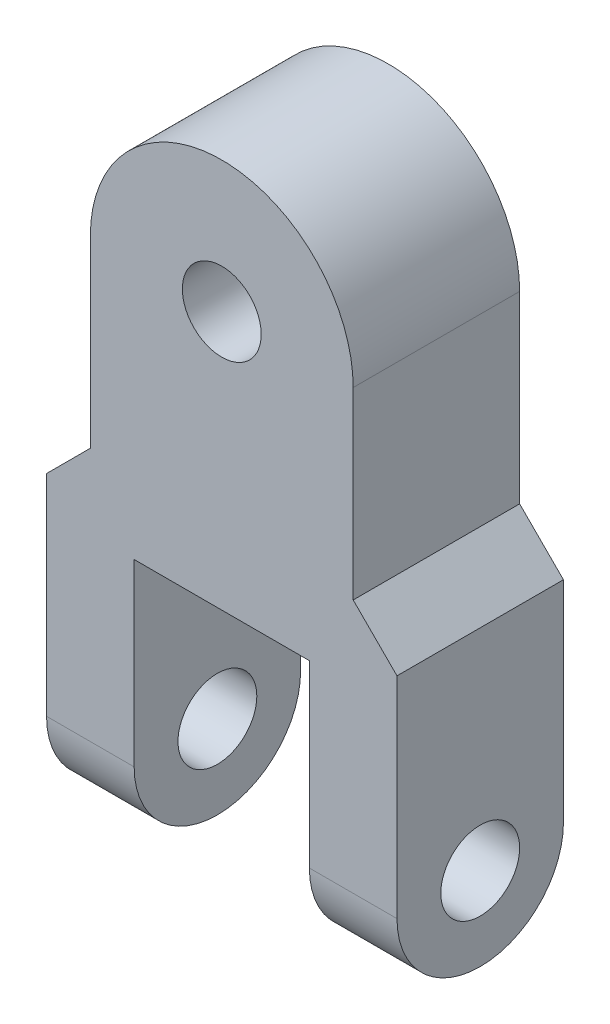
ISO-10303-21;
HEADER;
FILE_DESCRIPTION(('STEP AP214'),'2;1');
FILE_NAME('part.step','',(''),(''),'','','');
FILE_SCHEMA(('AUTOMOTIVE_DESIGN { 1 0 10303 214 1 1 1 1 }'));
ENDSEC;
DATA;
#1=APPLICATION_CONTEXT('core data for automotive mechanical design processes');
#2=APPLICATION_PROTOCOL_DEFINITION('international standard','automotive_design',2000,#1);
#3=PRODUCT_CONTEXT('',#1,'mechanical');
#4=PRODUCT('Part','Part','',(#3));
#5=PRODUCT_RELATED_PRODUCT_CATEGORY('part','',(#4));
#6=PRODUCT_DEFINITION_FORMATION('','',#4);
#7=PRODUCT_DEFINITION_CONTEXT('part definition',#1,'design');
#8=PRODUCT_DEFINITION('design','',#6,#7);
#9=PRODUCT_DEFINITION_SHAPE('','',#8);
#10=(LENGTH_UNIT() NAMED_UNIT(*) SI_UNIT(.MILLI.,.METRE.));
#11=(NAMED_UNIT(*) PLANE_ANGLE_UNIT() SI_UNIT($,.RADIAN.));
#12=(NAMED_UNIT(*) SI_UNIT($,.STERADIAN.) SOLID_ANGLE_UNIT());
#13=UNCERTAINTY_MEASURE_WITH_UNIT(LENGTH_MEASURE(1.E-05),#10,'distance_accuracy_value','');
#14=(GEOMETRIC_REPRESENTATION_CONTEXT(3) GLOBAL_UNCERTAINTY_ASSIGNED_CONTEXT((#13)) GLOBAL_UNIT_ASSIGNED_CONTEXT((#10,
#11,#12)) REPRESENTATION_CONTEXT('',''));
#15=CARTESIAN_POINT('',(0.,0.,0.));
#16=DIRECTION('',(0.,0.,1.));
#17=DIRECTION('',(1.,0.,0.));
#18=AXIS2_PLACEMENT_3D('',#15,#16,#17);
#19=CARTESIAN_POINT('',(7.5,10.,9.5));
#20=DIRECTION('',(0.,0.,-1.));
#21=DIRECTION('',(-1.,0.,0.));
#22=AXIS2_PLACEMENT_3D('',#19,#20,#21);
#23=PLANE('',#22);
#24=CARTESIAN_POINT('',(7.5,10.,9.5));
#25=DIRECTION('',(0.,0.,1.));
#26=DIRECTION('',(1.,0.,0.));
#27=AXIS2_PLACEMENT_3D('',#24,#25,#26);
#28=CIRCLE('',#27,2.25);
#29=CARTESIAN_POINT('',(9.75,10.,9.5));
#30=VERTEX_POINT('',#29);
#31=EDGE_CURVE('E197',#30,#30,#28,.T.);
#32=ORIENTED_EDGE('',*,*,#31,.F.);
#33=EDGE_LOOP('',(#32));
#34=FACE_BOUND('',#33,.T.);
#35=DIRECTION('',(0.,-1.,0.));
#36=VECTOR('',#35,1.);
#37=CARTESIAN_POINT('',(0.,0.,9.5));
#38=LINE('',#37,#36);
#39=CARTESIAN_POINT('',(0.,10.,9.5));
#40=VERTEX_POINT('',#39);
#41=CARTESIAN_POINT('',(0.,-0.500000000000047,9.5));
#42=VERTEX_POINT('',#41);
#43=EDGE_CURVE('E202',#40,#42,#38,.T.);
#44=ORIENTED_EDGE('',*,*,#43,.T.);
#45=DIRECTION('',(-0.707106781186551,-0.707106781186544,0.));
#46=VECTOR('',#45,1.);
#47=CARTESIAN_POINT('',(0.500000000000052,0.,9.5));
#48=LINE('',#47,#46);
#49=CARTESIAN_POINT('',(-2.5,-3.00000000000002,9.5));
#50=VERTEX_POINT('',#49);
#51=EDGE_CURVE('E225',#42,#50,#48,.T.);
#52=ORIENTED_EDGE('',*,*,#51,.T.);
#53=DIRECTION('',(0.,-1.,0.));
#54=VECTOR('',#53,1.);
#55=CARTESIAN_POINT('',(-2.5,0.,9.5));
#56=LINE('',#55,#54);
#57=CARTESIAN_POINT('',(-2.5,-15.,9.5));
#58=VERTEX_POINT('',#57);
#59=EDGE_CURVE('E181',#50,#58,#56,.T.);
#60=ORIENTED_EDGE('',*,*,#59,.T.);
#61=DIRECTION('',(1.,0.,0.));
#62=VECTOR('',#61,1.);
#63=CARTESIAN_POINT('',(-2.5,-15.,9.5));
#64=LINE('',#63,#62);
#65=CARTESIAN_POINT('',(2.5,-15.,9.5));
#66=VERTEX_POINT('',#65);
#67=EDGE_CURVE('E194',#58,#66,#64,.T.);
#68=ORIENTED_EDGE('',*,*,#67,.T.);
#69=DIRECTION('',(0.,1.,0.));
#70=VECTOR('',#69,1.);
#71=CARTESIAN_POINT('',(2.5,-19.75,9.5));
#72=LINE('',#71,#70);
#73=CARTESIAN_POINT('',(2.50000000000001,-4.75,9.5));
#74=VERTEX_POINT('',#73);
#75=EDGE_CURVE('E160',#66,#74,#72,.T.);
#76=ORIENTED_EDGE('',*,*,#75,.T.);
#77=DIRECTION('',(1.,0.,0.));
#78=VECTOR('',#77,1.);
#79=CARTESIAN_POINT('',(12.5,-4.75,9.5));
#80=LINE('',#79,#78);
#81=CARTESIAN_POINT('',(12.5,-4.75,9.5));
#82=VERTEX_POINT('',#81);
#83=EDGE_CURVE('E144',#74,#82,#80,.T.);
#84=ORIENTED_EDGE('',*,*,#83,.T.);
#85=DIRECTION('',(0.,-1.,0.));
#86=VECTOR('',#85,1.);
#87=CARTESIAN_POINT('',(12.5,-19.75,9.5));
#88=LINE('',#87,#86);
#89=CARTESIAN_POINT('',(12.5,-15.,9.5));
#90=VERTEX_POINT('',#89);
#91=EDGE_CURVE('E157',#82,#90,#88,.T.);
#92=ORIENTED_EDGE('',*,*,#91,.T.);
#93=CARTESIAN_POINT('',(17.5,-15.,9.5));
#94=VERTEX_POINT('',#93);
#95=EDGE_CURVE('E189',#90,#94,#64,.T.);
#96=ORIENTED_EDGE('',*,*,#95,.T.);
#97=DIRECTION('',(0.,-1.,0.));
#98=VECTOR('',#97,1.);
#99=CARTESIAN_POINT('',(17.5,0.,9.5));
#100=LINE('',#99,#98);
#101=CARTESIAN_POINT('',(17.5,-3.00000000000005,9.5));
#102=VERTEX_POINT('',#101);
#103=EDGE_CURVE('E170',#102,#94,#100,.T.);
#104=ORIENTED_EDGE('',*,*,#103,.F.);
#105=DIRECTION('',(0.707106781186544,-0.707106781186551,0.));
#106=VECTOR('',#105,1.);
#107=CARTESIAN_POINT('',(17.5,-3.00000000000005,9.5));
#108=LINE('',#107,#106);
#109=CARTESIAN_POINT('',(15.,-0.500000000000025,9.5));
#110=VERTEX_POINT('',#109);
#111=EDGE_CURVE('E218',#102,#110,#108,.F.);
#112=ORIENTED_EDGE('',*,*,#111,.T.);
#113=DIRECTION('',(0.,1.,0.));
#114=VECTOR('',#113,1.);
#115=CARTESIAN_POINT('',(15.,0.,9.5));
#116=LINE('',#115,#114);
#117=CARTESIAN_POINT('',(15.,10.,9.5));
#118=VERTEX_POINT('',#117);
#119=EDGE_CURVE('E204',#110,#118,#116,.T.);
#120=ORIENTED_EDGE('',*,*,#119,.T.);
#121=CARTESIAN_POINT('',(7.5,10.,9.5));
#122=DIRECTION('',(0.,0.,1.));
#123=DIRECTION('',(-1.,0.,0.));
#124=AXIS2_PLACEMENT_3D('',#121,#122,#123);
#125=CIRCLE('',#124,7.5);
#126=EDGE_CURVE('E207',#118,#40,#125,.T.);
#127=ORIENTED_EDGE('',*,*,#126,.T.);
#128=EDGE_LOOP('',(#44,#52,#60,#68,#76,#84,#92,#96,#104,#112,#120,#127));
#129=FACE_BOUND('',#128,.T.);
#130=ADVANCED_FACE('F40',(#34,#129),#23,.F.);
#131=CARTESIAN_POINT('',(7.5,10.,0.));
#132=DIRECTION('',(0.,0.,-1.));
#133=DIRECTION('',(-1.,0.,0.));
#134=AXIS2_PLACEMENT_3D('',#131,#132,#133);
#135=PLANE('',#134);
#136=CARTESIAN_POINT('',(7.5,10.,0.));
#137=DIRECTION('',(0.,0.,1.));
#138=DIRECTION('',(1.,0.,0.));
#139=AXIS2_PLACEMENT_3D('',#136,#137,#138);
#140=CIRCLE('',#139,2.25);
#141=CARTESIAN_POINT('',(9.75,10.,0.));
#142=VERTEX_POINT('',#141);
#143=EDGE_CURVE('E192',#142,#142,#140,.T.);
#144=ORIENTED_EDGE('',*,*,#143,.T.);
#145=EDGE_LOOP('',(#144));
#146=FACE_BOUND('',#145,.T.);
#147=DIRECTION('',(0.707106781186551,0.707106781186544,0.));
#148=VECTOR('',#147,1.);
#149=CARTESIAN_POINT('',(9.00000000000006,8.49999999999992,0.));
#150=LINE('',#149,#148);
#151=CARTESIAN_POINT('',(-2.5,-3.00000000000002,0.));
#152=VERTEX_POINT('',#151);
#153=CARTESIAN_POINT('',(0.,-0.500000000000047,0.));
#154=VERTEX_POINT('',#153);
#155=EDGE_CURVE('E232',#152,#154,#150,.T.);
#156=ORIENTED_EDGE('',*,*,#155,.T.);
#157=DIRECTION('',(0.,-1.,0.));
#158=VECTOR('',#157,1.);
#159=CARTESIAN_POINT('',(0.,0.,0.));
#160=LINE('',#159,#158);
#161=CARTESIAN_POINT('',(0.,10.,0.));
#162=VERTEX_POINT('',#161);
#163=EDGE_CURVE('E57',#162,#154,#160,.T.);
#164=ORIENTED_EDGE('',*,*,#163,.F.);
#165=CARTESIAN_POINT('',(7.5,10.,0.));
#166=DIRECTION('',(0.,0.,1.));
#167=DIRECTION('',(-1.,0.,0.));
#168=AXIS2_PLACEMENT_3D('',#165,#166,#167);
#169=CIRCLE('',#168,7.5);
#170=CARTESIAN_POINT('',(15.,10.,0.));
#171=VERTEX_POINT('',#170);
#172=EDGE_CURVE('E205',#171,#162,#169,.T.);
#173=ORIENTED_EDGE('',*,*,#172,.F.);
#174=DIRECTION('',(0.,1.,0.));
#175=VECTOR('',#174,1.);
#176=CARTESIAN_POINT('',(15.,0.,0.));
#177=LINE('',#176,#175);
#178=CARTESIAN_POINT('',(15.,-0.500000000000025,0.));
#179=VERTEX_POINT('',#178);
#180=EDGE_CURVE('E211',#179,#171,#177,.T.);
#181=ORIENTED_EDGE('',*,*,#180,.F.);
#182=DIRECTION('',(-0.707106781186544,0.707106781186551,0.));
#183=VECTOR('',#182,1.);
#184=CARTESIAN_POINT('',(6.00000000000003,8.50000000000004,0.));
#185=LINE('',#184,#183);
#186=CARTESIAN_POINT('',(17.5,-3.00000000000005,0.));
#187=VERTEX_POINT('',#186);
#188=EDGE_CURVE('E230',#179,#187,#185,.F.);
#189=ORIENTED_EDGE('',*,*,#188,.T.);
#190=DIRECTION('',(0.,1.,0.));
#191=VECTOR('',#190,1.);
#192=CARTESIAN_POINT('',(17.5,0.,0.));
#193=LINE('',#192,#191);
#194=CARTESIAN_POINT('',(17.5,-15.,0.));
#195=VERTEX_POINT('',#194);
#196=EDGE_CURVE('E175',#195,#187,#193,.T.);
#197=ORIENTED_EDGE('',*,*,#196,.F.);
#198=DIRECTION('',(1.,0.,0.));
#199=VECTOR('',#198,1.);
#200=CARTESIAN_POINT('',(-2.5,-15.,0.));
#201=LINE('',#200,#199);
#202=CARTESIAN_POINT('',(12.5,-15.,0.));
#203=VERTEX_POINT('',#202);
#204=EDGE_CURVE('E193',#203,#195,#201,.T.);
#205=ORIENTED_EDGE('',*,*,#204,.F.);
#206=DIRECTION('',(0.,-1.,0.));
#207=VECTOR('',#206,1.);
#208=CARTESIAN_POINT('',(12.5,-19.75,0.));
#209=LINE('',#208,#207);
#210=CARTESIAN_POINT('',(12.5,-4.75,0.));
#211=VERTEX_POINT('',#210);
#212=EDGE_CURVE('E138',#211,#203,#209,.T.);
#213=ORIENTED_EDGE('',*,*,#212,.F.);
#214=DIRECTION('',(1.,0.,0.));
#215=VECTOR('',#214,1.);
#216=CARTESIAN_POINT('',(12.5,-4.75,0.));
#217=LINE('',#216,#215);
#218=CARTESIAN_POINT('',(2.50000000000001,-4.75,0.));
#219=VERTEX_POINT('',#218);
#220=EDGE_CURVE('E137',#219,#211,#217,.T.);
#221=ORIENTED_EDGE('',*,*,#220,.F.);
#222=DIRECTION('',(0.,1.,0.));
#223=VECTOR('',#222,1.);
#224=CARTESIAN_POINT('',(2.5,-19.75,0.));
#225=LINE('',#224,#223);
#226=CARTESIAN_POINT('',(2.5,-15.,0.));
#227=VERTEX_POINT('',#226);
#228=EDGE_CURVE('E126',#227,#219,#225,.T.);
#229=ORIENTED_EDGE('',*,*,#228,.F.);
#230=CARTESIAN_POINT('',(-2.5,-15.,0.));
#231=VERTEX_POINT('',#230);
#232=EDGE_CURVE('E190',#231,#227,#201,.T.);
#233=ORIENTED_EDGE('',*,*,#232,.F.);
#234=DIRECTION('',(0.,1.,0.));
#235=VECTOR('',#234,1.);
#236=CARTESIAN_POINT('',(-2.5,0.,0.));
#237=LINE('',#236,#235);
#238=EDGE_CURVE('E186',#231,#152,#237,.T.);
#239=ORIENTED_EDGE('',*,*,#238,.T.);
#240=EDGE_LOOP('',(#156,#164,#173,#181,#189,#197,#205,#213,#221,#229,#233,#239));
#241=FACE_BOUND('',#240,.T.);
#242=ADVANCED_FACE('F150',(#146,#241),#135,.T.);
#243=CARTESIAN_POINT('',(-2.5,-15.,4.75));
#244=DIRECTION('',(1.,0.,0.));
#245=DIRECTION('',(0.,0.,-1.));
#246=AXIS2_PLACEMENT_3D('',#243,#244,#245);
#247=CYLINDRICAL_SURFACE('',#246,4.75);
#248=ORIENTED_EDGE('',*,*,#95,.F.);
#249=CARTESIAN_POINT('',(12.5,-15.,4.75));
#250=DIRECTION('',(-1.,0.,0.));
#251=DIRECTION('',(0.,0.,1.));
#252=AXIS2_PLACEMENT_3D('',#249,#250,#251);
#253=CIRCLE('',#252,4.75);
#254=EDGE_CURVE('E165',#90,#203,#253,.F.);
#255=ORIENTED_EDGE('',*,*,#254,.T.);
#256=ORIENTED_EDGE('',*,*,#204,.T.);
#257=CARTESIAN_POINT('',(17.5,-15.,4.75));
#258=DIRECTION('',(1.,0.,0.));
#259=DIRECTION('',(0.,0.,-1.));
#260=AXIS2_PLACEMENT_3D('',#257,#258,#259);
#261=CIRCLE('',#260,4.75);
#262=EDGE_CURVE('E172',#94,#195,#261,.T.);
#263=ORIENTED_EDGE('',*,*,#262,.F.);
#264=EDGE_LOOP('',(#248,#255,#256,#263));
#265=FACE_BOUND('',#264,.T.);
#266=ADVANCED_FACE('F259',(#265),#247,.T.);
#267=ORIENTED_EDGE('',*,*,#232,.T.);
#268=CARTESIAN_POINT('',(2.5,-15.,4.75));
#269=DIRECTION('',(1.,0.,0.));
#270=DIRECTION('',(0.,1.,0.));
#271=AXIS2_PLACEMENT_3D('',#268,#269,#270);
#272=CIRCLE('',#271,4.75);
#273=EDGE_CURVE('E133',#227,#66,#272,.F.);
#274=ORIENTED_EDGE('',*,*,#273,.T.);
#275=ORIENTED_EDGE('',*,*,#67,.F.);
#276=CARTESIAN_POINT('',(-2.5,-15.,4.75));
#277=DIRECTION('',(1.,0.,0.));
#278=DIRECTION('',(0.,0.,-1.));
#279=AXIS2_PLACEMENT_3D('',#276,#277,#278);
#280=CIRCLE('',#279,4.75);
#281=EDGE_CURVE('E183',#58,#231,#280,.T.);
#282=ORIENTED_EDGE('',*,*,#281,.T.);
#283=EDGE_LOOP('',(#267,#274,#275,#282));
#284=FACE_BOUND('',#283,.T.);
#285=ADVANCED_FACE('F251',(#284),#247,.T.);
#286=CARTESIAN_POINT('',(-2.5,-15.,4.75));
#287=DIRECTION('',(1.,0.,0.));
#288=DIRECTION('',(0.,0.,-1.));
#289=AXIS2_PLACEMENT_3D('',#286,#287,#288);
#290=CYLINDRICAL_SURFACE('',#289,2.25);
#291=CARTESIAN_POINT('',(17.5,-15.,4.75));
#292=DIRECTION('',(1.,0.,0.));
#293=DIRECTION('',(0.,0.,-1.));
#294=AXIS2_PLACEMENT_3D('',#291,#292,#293);
#295=CIRCLE('',#294,2.25);
#296=CARTESIAN_POINT('',(17.5,-15.,2.5));
#297=VERTEX_POINT('',#296);
#298=EDGE_CURVE('E167',#297,#297,#295,.T.);
#299=ORIENTED_EDGE('',*,*,#298,.T.);
#300=EDGE_LOOP('',(#299));
#301=FACE_BOUND('',#300,.T.);
#302=CARTESIAN_POINT('',(12.5,-15.,4.75));
#303=DIRECTION('',(-1.,0.,0.));
#304=DIRECTION('',(0.,0.,1.));
#305=AXIS2_PLACEMENT_3D('',#302,#303,#304);
#306=CIRCLE('',#305,2.25);
#307=CARTESIAN_POINT('',(12.5,-15.,7.));
#308=VERTEX_POINT('',#307);
#309=EDGE_CURVE('E164',#308,#308,#306,.F.);
#310=ORIENTED_EDGE('',*,*,#309,.F.);
#311=EDGE_LOOP('',(#310));
#312=FACE_BOUND('',#311,.T.);
#313=ADVANCED_FACE('F303',(#301,#312),#290,.F.);
#314=CARTESIAN_POINT('',(-2.5,-15.,4.75));
#315=DIRECTION('',(1.,0.,0.));
#316=DIRECTION('',(0.,0.,-1.));
#317=AXIS2_PLACEMENT_3D('',#314,#315,#316);
#318=CIRCLE('',#317,2.25);
#319=CARTESIAN_POINT('',(-2.5,-15.,2.5));
#320=VERTEX_POINT('',#319);
#321=EDGE_CURVE('E178',#320,#320,#318,.T.);
#322=ORIENTED_EDGE('',*,*,#321,.F.);
#323=EDGE_LOOP('',(#322));
#324=FACE_BOUND('',#323,.T.);
#325=CARTESIAN_POINT('',(2.5,-15.,4.75));
#326=DIRECTION('',(1.,0.,0.));
#327=DIRECTION('',(0.,1.,0.));
#328=AXIS2_PLACEMENT_3D('',#325,#326,#327);
#329=CIRCLE('',#328,2.25);
#330=CARTESIAN_POINT('',(2.5,-12.75,4.75));
#331=VERTEX_POINT('',#330);
#332=EDGE_CURVE('E146',#331,#331,#329,.F.);
#333=ORIENTED_EDGE('',*,*,#332,.F.);
#334=EDGE_LOOP('',(#333));
#335=FACE_BOUND('',#334,.T.);
#336=ADVANCED_FACE('F306',(#324,#335),#290,.F.);
#337=CARTESIAN_POINT('',(0.,0.,9.5));
#338=DIRECTION('',(1.,0.,0.));
#339=DIRECTION('',(0.,0.,-1.));
#340=AXIS2_PLACEMENT_3D('',#337,#338,#339);
#341=PLANE('',#340);
#342=ORIENTED_EDGE('',*,*,#163,.T.);
#343=DIRECTION('',(0.,0.,1.));
#344=VECTOR('',#343,1.);
#345=CARTESIAN_POINT('',(0.,-0.500000000000047,9.5));
#346=LINE('',#345,#344);
#347=EDGE_CURVE('E50',#154,#42,#346,.T.);
#348=ORIENTED_EDGE('',*,*,#347,.T.);
#349=ORIENTED_EDGE('',*,*,#43,.F.);
#350=DIRECTION('',(0.,0.,-1.));
#351=VECTOR('',#350,1.);
#352=CARTESIAN_POINT('',(0.,10.,9.5));
#353=LINE('',#352,#351);
#354=EDGE_CURVE('E209',#40,#162,#353,.T.);
#355=ORIENTED_EDGE('',*,*,#354,.T.);
#356=EDGE_LOOP('',(#342,#348,#349,#355));
#357=FACE_BOUND('',#356,.T.);
#358=ADVANCED_FACE('F239',(#357),#341,.F.);
#359=CARTESIAN_POINT('',(15.,0.,9.5));
#360=DIRECTION('',(-1.,0.,0.));
#361=DIRECTION('',(0.,0.,1.));
#362=AXIS2_PLACEMENT_3D('',#359,#360,#361);
#363=PLANE('',#362);
#364=ORIENTED_EDGE('',*,*,#180,.T.);
#365=DIRECTION('',(0.,0.,-1.));
#366=VECTOR('',#365,1.);
#367=CARTESIAN_POINT('',(15.,10.,9.5));
#368=LINE('',#367,#366);
#369=EDGE_CURVE('E215',#118,#171,#368,.T.);
#370=ORIENTED_EDGE('',*,*,#369,.F.);
#371=ORIENTED_EDGE('',*,*,#119,.F.);
#372=DIRECTION('',(0.,0.,1.));
#373=VECTOR('',#372,1.);
#374=CARTESIAN_POINT('',(15.,-0.500000000000025,9.5));
#375=LINE('',#374,#373);
#376=EDGE_CURVE('E11',#110,#179,#375,.F.);
#377=ORIENTED_EDGE('',*,*,#376,.T.);
#378=EDGE_LOOP('',(#364,#370,#371,#377));
#379=FACE_BOUND('',#378,.T.);
#380=ADVANCED_FACE('F272',(#379),#363,.F.);
#381=CARTESIAN_POINT('',(7.5,10.,9.5));
#382=DIRECTION('',(0.,0.,-1.));
#383=DIRECTION('',(-1.,0.,0.));
#384=AXIS2_PLACEMENT_3D('',#381,#382,#383);
#385=CYLINDRICAL_SURFACE('',#384,7.5);
#386=ORIENTED_EDGE('',*,*,#172,.T.);
#387=ORIENTED_EDGE('',*,*,#354,.F.);
#388=ORIENTED_EDGE('',*,*,#126,.F.);
#389=ORIENTED_EDGE('',*,*,#369,.T.);
#390=EDGE_LOOP('',(#386,#387,#388,#389));
#391=FACE_BOUND('',#390,.T.);
#392=ADVANCED_FACE('F276',(#391),#385,.T.);
#393=CARTESIAN_POINT('',(7.5,10.,9.5));
#394=DIRECTION('',(0.,0.,-1.));
#395=DIRECTION('',(-1.,0.,0.));
#396=AXIS2_PLACEMENT_3D('',#393,#394,#395);
#397=CYLINDRICAL_SURFACE('',#396,2.25);
#398=ORIENTED_EDGE('',*,*,#31,.T.);
#399=EDGE_LOOP('',(#398));
#400=FACE_BOUND('',#399,.T.);
#401=ORIENTED_EDGE('',*,*,#143,.F.);
#402=EDGE_LOOP('',(#401));
#403=FACE_BOUND('',#402,.T.);
#404=ADVANCED_FACE('F278',(#400,#403),#397,.F.);
#405=CARTESIAN_POINT('',(-2.5,-15.,4.75));
#406=DIRECTION('',(1.,0.,0.));
#407=DIRECTION('',(0.,0.,-1.));
#408=AXIS2_PLACEMENT_3D('',#405,#406,#407);
#409=PLANE('',#408);
#410=ORIENTED_EDGE('',*,*,#321,.T.);
#411=EDGE_LOOP('',(#410));
#412=FACE_BOUND('',#411,.T.);
#413=ORIENTED_EDGE('',*,*,#59,.F.);
#414=DIRECTION('',(0.,0.,-1.));
#415=VECTOR('',#414,1.);
#416=CARTESIAN_POINT('',(-2.5,-3.00000000000002,0.));
#417=LINE('',#416,#415);
#418=EDGE_CURVE('E227',#50,#152,#417,.T.);
#419=ORIENTED_EDGE('',*,*,#418,.T.);
#420=ORIENTED_EDGE('',*,*,#238,.F.);
#421=ORIENTED_EDGE('',*,*,#281,.F.);
#422=EDGE_LOOP('',(#413,#419,#420,#421));
#423=FACE_BOUND('',#422,.T.);
#424=ADVANCED_FACE('F248',(#412,#423),#409,.F.);
#425=CARTESIAN_POINT('',(17.5,-15.,4.75));
#426=DIRECTION('',(1.,0.,0.));
#427=DIRECTION('',(0.,0.,-1.));
#428=AXIS2_PLACEMENT_3D('',#425,#426,#427);
#429=PLANE('',#428);
#430=ORIENTED_EDGE('',*,*,#196,.T.);
#431=DIRECTION('',(0.,0.,1.));
#432=VECTOR('',#431,1.);
#433=CARTESIAN_POINT('',(17.5,-3.00000000000005,4.75));
#434=LINE('',#433,#432);
#435=EDGE_CURVE('E234',#187,#102,#434,.T.);
#436=ORIENTED_EDGE('',*,*,#435,.T.);
#437=ORIENTED_EDGE('',*,*,#103,.T.);
#438=ORIENTED_EDGE('',*,*,#262,.T.);
#439=EDGE_LOOP('',(#430,#436,#437,#438));
#440=FACE_BOUND('',#439,.T.);
#441=ORIENTED_EDGE('',*,*,#298,.F.);
#442=EDGE_LOOP('',(#441));
#443=FACE_BOUND('',#442,.T.);
#444=ADVANCED_FACE('F262',(#440,#443),#429,.T.);
#445=CARTESIAN_POINT('',(12.5,-19.75,0.));
#446=DIRECTION('',(-1.,0.,0.));
#447=DIRECTION('',(0.,0.,1.));
#448=AXIS2_PLACEMENT_3D('',#445,#446,#447);
#449=PLANE('',#448);
#450=ORIENTED_EDGE('',*,*,#91,.F.);
#451=DIRECTION('',(0.,0.,1.));
#452=VECTOR('',#451,1.);
#453=CARTESIAN_POINT('',(12.5,-4.75,0.));
#454=LINE('',#453,#452);
#455=EDGE_CURVE('E147',#211,#82,#454,.T.);
#456=ORIENTED_EDGE('',*,*,#455,.F.);
#457=ORIENTED_EDGE('',*,*,#212,.T.);
#458=ORIENTED_EDGE('',*,*,#254,.F.);
#459=EDGE_LOOP('',(#450,#456,#457,#458));
#460=FACE_BOUND('',#459,.T.);
#461=ORIENTED_EDGE('',*,*,#309,.T.);
#462=EDGE_LOOP('',(#461));
#463=FACE_BOUND('',#462,.T.);
#464=ADVANCED_FACE('F310',(#460,#463),#449,.T.);
#465=CARTESIAN_POINT('',(2.5,-19.75,0.));
#466=DIRECTION('',(1.,0.,0.));
#467=DIRECTION('',(0.,1.,0.));
#468=AXIS2_PLACEMENT_3D('',#465,#466,#467);
#469=PLANE('',#468);
#470=ORIENTED_EDGE('',*,*,#228,.T.);
#471=DIRECTION('',(0.,0.,1.));
#472=VECTOR('',#471,1.);
#473=CARTESIAN_POINT('',(2.50000000000001,-4.75,0.));
#474=LINE('',#473,#472);
#475=EDGE_CURVE('E131',#219,#74,#474,.T.);
#476=ORIENTED_EDGE('',*,*,#475,.T.);
#477=ORIENTED_EDGE('',*,*,#75,.F.);
#478=ORIENTED_EDGE('',*,*,#273,.F.);
#479=EDGE_LOOP('',(#470,#476,#477,#478));
#480=FACE_BOUND('',#479,.T.);
#481=ORIENTED_EDGE('',*,*,#332,.T.);
#482=EDGE_LOOP('',(#481));
#483=FACE_BOUND('',#482,.T.);
#484=ADVANCED_FACE('F128',(#480,#483),#469,.T.);
#485=CARTESIAN_POINT('',(12.5,-4.75,0.));
#486=DIRECTION('',(0.,-1.,0.));
#487=DIRECTION('',(1.,0.,0.));
#488=AXIS2_PLACEMENT_3D('',#485,#486,#487);
#489=PLANE('',#488);
#490=ORIENTED_EDGE('',*,*,#83,.F.);
#491=ORIENTED_EDGE('',*,*,#475,.F.);
#492=ORIENTED_EDGE('',*,*,#220,.T.);
#493=ORIENTED_EDGE('',*,*,#455,.T.);
#494=EDGE_LOOP('',(#490,#491,#492,#493));
#495=FACE_BOUND('',#494,.T.);
#496=ADVANCED_FACE('F141',(#495),#489,.T.);
#497=CARTESIAN_POINT('',(0.500000000000052,0.,9.5));
#498=DIRECTION('',(-0.707106781186544,0.707106781186551,0.));
#499=DIRECTION('',(0.,0.,-1.));
#500=AXIS2_PLACEMENT_3D('',#497,#498,#499);
#501=PLANE('',#500);
#502=ORIENTED_EDGE('',*,*,#155,.F.);
#503=ORIENTED_EDGE('',*,*,#418,.F.);
#504=ORIENTED_EDGE('',*,*,#51,.F.);
#505=ORIENTED_EDGE('',*,*,#347,.F.);
#506=EDGE_LOOP('',(#502,#503,#504,#505));
#507=FACE_BOUND('',#506,.T.);
#508=ADVANCED_FACE('F242',(#507),#501,.T.);
#509=CARTESIAN_POINT('',(17.5,-3.00000000000005,4.75));
#510=DIRECTION('',(-0.707106781186551,-0.707106781186544,0.));
#511=DIRECTION('',(0.,0.,1.));
#512=AXIS2_PLACEMENT_3D('',#509,#510,#511);
#513=PLANE('',#512);
#514=ORIENTED_EDGE('',*,*,#188,.F.);
#515=ORIENTED_EDGE('',*,*,#376,.F.);
#516=ORIENTED_EDGE('',*,*,#111,.F.);
#517=ORIENTED_EDGE('',*,*,#435,.F.);
#518=EDGE_LOOP('',(#514,#515,#516,#517));
#519=FACE_BOUND('',#518,.T.);
#520=ADVANCED_FACE('F43',(#519),#513,.F.);
#521=CLOSED_SHELL('',(#130,#242,#266,#285,#313,#336,#358,#380,#392,#404,#424,#444,#464,#484,
#496,#508,#520));
#522=MANIFOLD_SOLID_BREP('B2',#521);
#523=ADVANCED_BREP_SHAPE_REPRESENTATION('',(#18,#522),#14);
#524=SHAPE_DEFINITION_REPRESENTATION(#9,#523);
ENDSEC;
END-ISO-10303-21;
